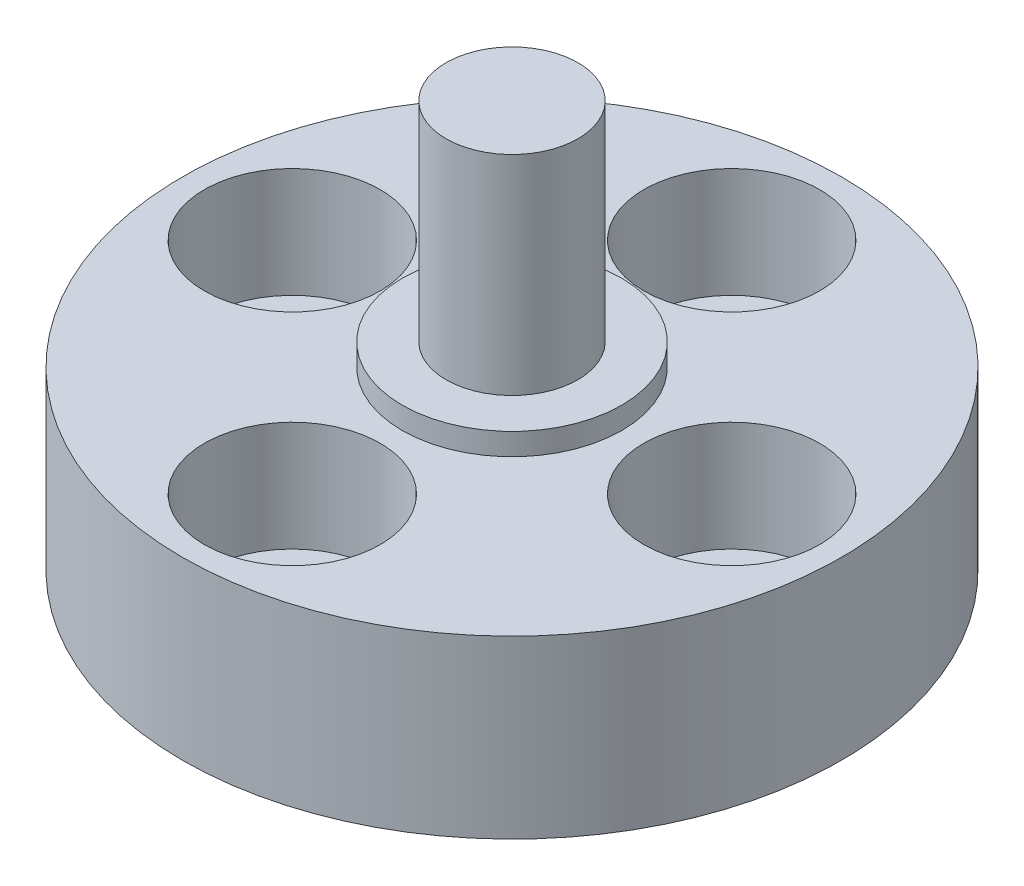
ISO-10303-21;
HEADER;
FILE_DESCRIPTION(('STEP AP214'),'2;1');
FILE_NAME('part.step','',(''),(''),'','','');
FILE_SCHEMA(('AUTOMOTIVE_DESIGN { 1 0 10303 214 1 1 1 1 }'));
ENDSEC;
DATA;
#1=APPLICATION_CONTEXT('core data for automotive mechanical design processes');
#2=APPLICATION_PROTOCOL_DEFINITION('international standard','automotive_design',2000,#1);
#3=PRODUCT_CONTEXT('',#1,'mechanical');
#4=PRODUCT('Part','Part','',(#3));
#5=PRODUCT_RELATED_PRODUCT_CATEGORY('part','',(#4));
#6=PRODUCT_DEFINITION_FORMATION('','',#4);
#7=PRODUCT_DEFINITION_CONTEXT('part definition',#1,'design');
#8=PRODUCT_DEFINITION('design','',#6,#7);
#9=PRODUCT_DEFINITION_SHAPE('','',#8);
#10=(LENGTH_UNIT() NAMED_UNIT(*) SI_UNIT(.MILLI.,.METRE.));
#11=(NAMED_UNIT(*) PLANE_ANGLE_UNIT() SI_UNIT($,.RADIAN.));
#12=(NAMED_UNIT(*) SI_UNIT($,.STERADIAN.) SOLID_ANGLE_UNIT());
#13=UNCERTAINTY_MEASURE_WITH_UNIT(LENGTH_MEASURE(1.E-05),#10,'distance_accuracy_value','');
#14=(GEOMETRIC_REPRESENTATION_CONTEXT(3) GLOBAL_UNCERTAINTY_ASSIGNED_CONTEXT((#13)) GLOBAL_UNIT_ASSIGNED_CONTEXT((#10,
#11,#12)) REPRESENTATION_CONTEXT('',''));
#15=CARTESIAN_POINT('',(0.,0.,0.));
#16=DIRECTION('',(0.,0.,1.));
#17=DIRECTION('',(1.,0.,0.));
#18=AXIS2_PLACEMENT_3D('',#15,#16,#17);
#19=CARTESIAN_POINT('',(0.,8.,0.));
#20=DIRECTION('',(0.,-1.,0.));
#21=DIRECTION('',(0.,0.,-1.));
#22=AXIS2_PLACEMENT_3D('',#19,#20,#21);
#23=CYLINDRICAL_SURFACE('',#22,15.);
#24=CARTESIAN_POINT('',(0.,8.,0.));
#25=DIRECTION('',(0.,1.,0.));
#26=DIRECTION('',(0.,0.,1.));
#27=AXIS2_PLACEMENT_3D('',#24,#25,#26);
#28=CIRCLE('',#27,15.);
#29=CARTESIAN_POINT('',(0.,8.,15.));
#30=VERTEX_POINT('',#29);
#31=EDGE_CURVE('E57',#30,#30,#28,.T.);
#32=ORIENTED_EDGE('',*,*,#31,.F.);
#33=EDGE_LOOP('',(#32));
#34=FACE_BOUND('',#33,.T.);
#35=CARTESIAN_POINT('',(0.,0.,0.));
#36=DIRECTION('',(0.,1.,0.));
#37=DIRECTION('',(0.,0.,1.));
#38=AXIS2_PLACEMENT_3D('',#35,#36,#37);
#39=CIRCLE('',#38,15.);
#40=CARTESIAN_POINT('',(0.,0.,15.));
#41=VERTEX_POINT('',#40);
#42=EDGE_CURVE('E46',#41,#41,#39,.T.);
#43=ORIENTED_EDGE('',*,*,#42,.T.);
#44=EDGE_LOOP('',(#43));
#45=FACE_BOUND('',#44,.T.);
#46=ADVANCED_FACE('F43',(#34,#45),#23,.T.);
#47=CARTESIAN_POINT('',(0.,8.,0.));
#48=DIRECTION('',(0.,1.,0.));
#49=DIRECTION('',(0.,0.,1.));
#50=AXIS2_PLACEMENT_3D('',#47,#48,#49);
#51=PLANE('',#50);
#52=CARTESIAN_POINT('',(-10.,8.,0.));
#53=DIRECTION('',(0.,1.,0.));
#54=DIRECTION('',(0.,0.,1.));
#55=AXIS2_PLACEMENT_3D('',#52,#53,#54);
#56=CIRCLE('',#55,4.00000000000001);
#57=CARTESIAN_POINT('',(-10.,8.,4.00000000000001));
#58=VERTEX_POINT('',#57);
#59=EDGE_CURVE('E269',#58,#58,#56,.T.);
#60=ORIENTED_EDGE('',*,*,#59,.F.);
#61=EDGE_LOOP('',(#60));
#62=FACE_BOUND('',#61,.T.);
#63=CARTESIAN_POINT('',(0.,8.,-10.));
#64=DIRECTION('',(0.,1.,0.));
#65=DIRECTION('',(0.,0.,1.));
#66=AXIS2_PLACEMENT_3D('',#63,#64,#65);
#67=CIRCLE('',#66,4.00000000000001);
#68=CARTESIAN_POINT('',(0.,8.,-5.99999999999999));
#69=VERTEX_POINT('',#68);
#70=EDGE_CURVE('E282',#69,#69,#67,.T.);
#71=ORIENTED_EDGE('',*,*,#70,.F.);
#72=EDGE_LOOP('',(#71));
#73=FACE_BOUND('',#72,.T.);
#74=CARTESIAN_POINT('',(10.,8.,0.));
#75=DIRECTION('',(0.,1.,0.));
#76=DIRECTION('',(0.,0.,1.));
#77=AXIS2_PLACEMENT_3D('',#74,#75,#76);
#78=CIRCLE('',#77,4.00000000000001);
#79=CARTESIAN_POINT('',(10.,8.,4.00000000000001));
#80=VERTEX_POINT('',#79);
#81=EDGE_CURVE('E298',#80,#80,#78,.T.);
#82=ORIENTED_EDGE('',*,*,#81,.F.);
#83=EDGE_LOOP('',(#82));
#84=FACE_BOUND('',#83,.T.);
#85=CARTESIAN_POINT('',(0.,8.,10.));
#86=DIRECTION('',(0.,1.,0.));
#87=DIRECTION('',(0.,0.,1.));
#88=AXIS2_PLACEMENT_3D('',#85,#86,#87);
#89=CIRCLE('',#88,4.00000000000001);
#90=CARTESIAN_POINT('',(0.,8.,14.));
#91=VERTEX_POINT('',#90);
#92=EDGE_CURVE('E314',#91,#91,#89,.T.);
#93=ORIENTED_EDGE('',*,*,#92,.F.);
#94=EDGE_LOOP('',(#93));
#95=FACE_BOUND('',#94,.T.);
#96=CARTESIAN_POINT('',(0.,8.,0.));
#97=DIRECTION('',(0.,1.,0.));
#98=DIRECTION('',(0.,0.,1.));
#99=AXIS2_PLACEMENT_3D('',#96,#97,#98);
#100=CIRCLE('',#99,5.);
#101=CARTESIAN_POINT('',(0.,8.,5.));
#102=VERTEX_POINT('',#101);
#103=EDGE_CURVE('E51',#102,#102,#100,.T.);
#104=ORIENTED_EDGE('',*,*,#103,.F.);
#105=EDGE_LOOP('',(#104));
#106=FACE_BOUND('',#105,.T.);
#107=ORIENTED_EDGE('',*,*,#31,.T.);
#108=EDGE_LOOP('',(#107));
#109=FACE_BOUND('',#108,.T.);
#110=ADVANCED_FACE('F78',(#62,#73,#84,#95,#106,#109),#51,.T.);
#111=CARTESIAN_POINT('',(0.,0.,0.));
#112=DIRECTION('',(0.,1.,0.));
#113=DIRECTION('',(0.,0.,1.));
#114=AXIS2_PLACEMENT_3D('',#111,#112,#113);
#115=PLANE('',#114);
#116=CARTESIAN_POINT('',(-10.,0.,0.));
#117=DIRECTION('',(0.,1.,0.));
#118=DIRECTION('',(0.,0.,1.));
#119=AXIS2_PLACEMENT_3D('',#116,#117,#118);
#120=CIRCLE('',#119,2.00000000000001);
#121=CARTESIAN_POINT('',(-10.,0.,2.00000000000001));
#122=VERTEX_POINT('',#121);
#123=EDGE_CURVE('E279',#122,#122,#120,.T.);
#124=ORIENTED_EDGE('',*,*,#123,.T.);
#125=EDGE_LOOP('',(#124));
#126=FACE_BOUND('',#125,.T.);
#127=CARTESIAN_POINT('',(0.,0.,-10.));
#128=DIRECTION('',(0.,1.,0.));
#129=DIRECTION('',(0.,0.,1.));
#130=AXIS2_PLACEMENT_3D('',#127,#128,#129);
#131=CIRCLE('',#130,2.00000000000001);
#132=CARTESIAN_POINT('',(0.,0.,-7.99999999999999));
#133=VERTEX_POINT('',#132);
#134=EDGE_CURVE('E294',#133,#133,#131,.T.);
#135=ORIENTED_EDGE('',*,*,#134,.T.);
#136=EDGE_LOOP('',(#135));
#137=FACE_BOUND('',#136,.T.);
#138=CARTESIAN_POINT('',(10.,0.,0.));
#139=DIRECTION('',(0.,1.,0.));
#140=DIRECTION('',(0.,0.,1.));
#141=AXIS2_PLACEMENT_3D('',#138,#139,#140);
#142=CIRCLE('',#141,2.00000000000001);
#143=CARTESIAN_POINT('',(10.,0.,2.00000000000001));
#144=VERTEX_POINT('',#143);
#145=EDGE_CURVE('E310',#144,#144,#142,.T.);
#146=ORIENTED_EDGE('',*,*,#145,.T.);
#147=EDGE_LOOP('',(#146));
#148=FACE_BOUND('',#147,.T.);
#149=CARTESIAN_POINT('',(0.,0.,10.));
#150=DIRECTION('',(0.,1.,0.));
#151=DIRECTION('',(0.,0.,1.));
#152=AXIS2_PLACEMENT_3D('',#149,#150,#151);
#153=CIRCLE('',#152,2.00000000000001);
#154=CARTESIAN_POINT('',(0.,0.,12.));
#155=VERTEX_POINT('',#154);
#156=EDGE_CURVE('E325',#155,#155,#153,.T.);
#157=ORIENTED_EDGE('',*,*,#156,.T.);
#158=EDGE_LOOP('',(#157));
#159=FACE_BOUND('',#158,.T.);
#160=ORIENTED_EDGE('',*,*,#42,.F.);
#161=EDGE_LOOP('',(#160));
#162=FACE_BOUND('',#161,.T.);
#163=ADVANCED_FACE('F75',(#126,#137,#148,#159,#162),#115,.F.);
#164=CARTESIAN_POINT('',(0.,9.,0.));
#165=DIRECTION('',(0.,-1.,0.));
#166=DIRECTION('',(0.,0.,-1.));
#167=AXIS2_PLACEMENT_3D('',#164,#165,#166);
#168=CYLINDRICAL_SURFACE('',#167,5.);
#169=CARTESIAN_POINT('',(0.,9.,0.));
#170=DIRECTION('',(0.,1.,0.));
#171=DIRECTION('',(0.,0.,1.));
#172=AXIS2_PLACEMENT_3D('',#169,#170,#171);
#173=CIRCLE('',#172,5.);
#174=CARTESIAN_POINT('',(0.,9.,5.));
#175=VERTEX_POINT('',#174);
#176=EDGE_CURVE('E63',#175,#175,#173,.T.);
#177=ORIENTED_EDGE('',*,*,#176,.F.);
#178=EDGE_LOOP('',(#177));
#179=FACE_BOUND('',#178,.T.);
#180=ORIENTED_EDGE('',*,*,#103,.T.);
#181=EDGE_LOOP('',(#180));
#182=FACE_BOUND('',#181,.T.);
#183=ADVANCED_FACE('F77',(#179,#182),#168,.T.);
#184=CARTESIAN_POINT('',(0.,9.,0.));
#185=DIRECTION('',(0.,1.,0.));
#186=DIRECTION('',(0.,0.,1.));
#187=AXIS2_PLACEMENT_3D('',#184,#185,#186);
#188=PLANE('',#187);
#189=CARTESIAN_POINT('',(0.,9.,0.));
#190=DIRECTION('',(0.,1.,0.));
#191=DIRECTION('',(0.,0.,1.));
#192=AXIS2_PLACEMENT_3D('',#189,#190,#191);
#193=CIRCLE('',#192,3.);
#194=CARTESIAN_POINT('',(0.,9.,3.));
#195=VERTEX_POINT('',#194);
#196=EDGE_CURVE('E10',#195,#195,#193,.T.);
#197=ORIENTED_EDGE('',*,*,#196,.F.);
#198=EDGE_LOOP('',(#197));
#199=FACE_BOUND('',#198,.T.);
#200=ORIENTED_EDGE('',*,*,#176,.T.);
#201=EDGE_LOOP('',(#200));
#202=FACE_BOUND('',#201,.T.);
#203=ADVANCED_FACE('F85',(#199,#202),#188,.T.);
#204=CARTESIAN_POINT('',(0.,18.5,0.));
#205=DIRECTION('',(0.,-1.,0.));
#206=DIRECTION('',(0.,0.,-1.));
#207=AXIS2_PLACEMENT_3D('',#204,#205,#206);
#208=CYLINDRICAL_SURFACE('',#207,3.);
#209=CARTESIAN_POINT('',(0.,18.5,0.));
#210=DIRECTION('',(0.,1.,0.));
#211=DIRECTION('',(0.,0.,1.));
#212=AXIS2_PLACEMENT_3D('',#209,#210,#211);
#213=CIRCLE('',#212,3.);
#214=CARTESIAN_POINT('',(0.,18.5,3.));
#215=VERTEX_POINT('',#214);
#216=EDGE_CURVE('E61',#215,#215,#213,.T.);
#217=ORIENTED_EDGE('',*,*,#216,.F.);
#218=EDGE_LOOP('',(#217));
#219=FACE_BOUND('',#218,.T.);
#220=ORIENTED_EDGE('',*,*,#196,.T.);
#221=EDGE_LOOP('',(#220));
#222=FACE_BOUND('',#221,.T.);
#223=ADVANCED_FACE('F109',(#219,#222),#208,.T.);
#224=CARTESIAN_POINT('',(0.,18.5,0.));
#225=DIRECTION('',(0.,1.,0.));
#226=DIRECTION('',(0.,0.,1.));
#227=AXIS2_PLACEMENT_3D('',#224,#225,#226);
#228=PLANE('',#227);
#229=ORIENTED_EDGE('',*,*,#216,.T.);
#230=EDGE_LOOP('',(#229));
#231=FACE_BOUND('',#230,.T.);
#232=ADVANCED_FACE('F118',(#231),#228,.T.);
#233=CARTESIAN_POINT('',(0.,8.,10.));
#234=DIRECTION('',(0.,1.,0.));
#235=DIRECTION('',(0.,0.,1.));
#236=AXIS2_PLACEMENT_3D('',#233,#234,#235);
#237=CYLINDRICAL_SURFACE('',#236,2.00000000000001);
#238=ORIENTED_EDGE('',*,*,#156,.F.);
#239=EDGE_LOOP('',(#238));
#240=FACE_BOUND('',#239,.T.);
#241=CARTESIAN_POINT('',(0.,3.,10.));
#242=DIRECTION('',(0.,1.,0.));
#243=DIRECTION('',(0.,0.,1.));
#244=AXIS2_PLACEMENT_3D('',#241,#242,#243);
#245=CIRCLE('',#244,2.00000000000001);
#246=CARTESIAN_POINT('',(0.,3.,12.));
#247=VERTEX_POINT('',#246);
#248=EDGE_CURVE('E322',#247,#247,#245,.T.);
#249=ORIENTED_EDGE('',*,*,#248,.T.);
#250=EDGE_LOOP('',(#249));
#251=FACE_BOUND('',#250,.T.);
#252=ADVANCED_FACE('F126',(#240,#251),#237,.F.);
#253=CARTESIAN_POINT('',(2.00000000000001,3.,10.));
#254=DIRECTION('',(0.,-1.,0.));
#255=DIRECTION('',(0.,0.,-1.));
#256=AXIS2_PLACEMENT_3D('',#253,#254,#255);
#257=PLANE('',#256);
#258=ORIENTED_EDGE('',*,*,#248,.F.);
#259=EDGE_LOOP('',(#258));
#260=FACE_BOUND('',#259,.T.);
#261=CARTESIAN_POINT('',(0.,3.,10.));
#262=DIRECTION('',(0.,1.,0.));
#263=DIRECTION('',(0.,0.,1.));
#264=AXIS2_PLACEMENT_3D('',#261,#262,#263);
#265=CIRCLE('',#264,4.00000000000001);
#266=CARTESIAN_POINT('',(0.,3.,14.));
#267=VERTEX_POINT('',#266);
#268=EDGE_CURVE('E318',#267,#267,#265,.T.);
#269=ORIENTED_EDGE('',*,*,#268,.T.);
#270=EDGE_LOOP('',(#269));
#271=FACE_BOUND('',#270,.T.);
#272=ADVANCED_FACE('F149',(#260,#271),#257,.F.);
#273=CARTESIAN_POINT('',(0.,8.,10.));
#274=DIRECTION('',(0.,1.,0.));
#275=DIRECTION('',(0.,0.,1.));
#276=AXIS2_PLACEMENT_3D('',#273,#274,#275);
#277=CYLINDRICAL_SURFACE('',#276,4.00000000000001);
#278=ORIENTED_EDGE('',*,*,#268,.F.);
#279=EDGE_LOOP('',(#278));
#280=FACE_BOUND('',#279,.T.);
#281=ORIENTED_EDGE('',*,*,#92,.T.);
#282=EDGE_LOOP('',(#281));
#283=FACE_BOUND('',#282,.T.);
#284=ADVANCED_FACE('F158',(#280,#283),#277,.F.);
#285=CARTESIAN_POINT('',(10.,8.,0.));
#286=DIRECTION('',(0.,1.,0.));
#287=DIRECTION('',(0.,0.,1.));
#288=AXIS2_PLACEMENT_3D('',#285,#286,#287);
#289=CYLINDRICAL_SURFACE('',#288,2.00000000000001);
#290=ORIENTED_EDGE('',*,*,#145,.F.);
#291=EDGE_LOOP('',(#290));
#292=FACE_BOUND('',#291,.T.);
#293=CARTESIAN_POINT('',(10.,3.,0.));
#294=DIRECTION('',(0.,1.,0.));
#295=DIRECTION('',(0.,0.,1.));
#296=AXIS2_PLACEMENT_3D('',#293,#294,#295);
#297=CIRCLE('',#296,2.00000000000001);
#298=CARTESIAN_POINT('',(10.,3.,2.00000000000001));
#299=VERTEX_POINT('',#298);
#300=EDGE_CURVE('E306',#299,#299,#297,.T.);
#301=ORIENTED_EDGE('',*,*,#300,.T.);
#302=EDGE_LOOP('',(#301));
#303=FACE_BOUND('',#302,.T.);
#304=ADVANCED_FACE('F167',(#292,#303),#289,.F.);
#305=CARTESIAN_POINT('',(12.,3.,0.));
#306=DIRECTION('',(0.,-1.,0.));
#307=DIRECTION('',(0.,0.,-1.));
#308=AXIS2_PLACEMENT_3D('',#305,#306,#307);
#309=PLANE('',#308);
#310=ORIENTED_EDGE('',*,*,#300,.F.);
#311=EDGE_LOOP('',(#310));
#312=FACE_BOUND('',#311,.T.);
#313=CARTESIAN_POINT('',(10.,3.,0.));
#314=DIRECTION('',(0.,1.,0.));
#315=DIRECTION('',(0.,0.,1.));
#316=AXIS2_PLACEMENT_3D('',#313,#314,#315);
#317=CIRCLE('',#316,4.00000000000001);
#318=CARTESIAN_POINT('',(10.,3.,4.00000000000001));
#319=VERTEX_POINT('',#318);
#320=EDGE_CURVE('E302',#319,#319,#317,.T.);
#321=ORIENTED_EDGE('',*,*,#320,.T.);
#322=EDGE_LOOP('',(#321));
#323=FACE_BOUND('',#322,.T.);
#324=ADVANCED_FACE('F176',(#312,#323),#309,.F.);
#325=CARTESIAN_POINT('',(10.,8.,0.));
#326=DIRECTION('',(0.,1.,0.));
#327=DIRECTION('',(0.,0.,1.));
#328=AXIS2_PLACEMENT_3D('',#325,#326,#327);
#329=CYLINDRICAL_SURFACE('',#328,4.00000000000001);
#330=ORIENTED_EDGE('',*,*,#320,.F.);
#331=EDGE_LOOP('',(#330));
#332=FACE_BOUND('',#331,.T.);
#333=ORIENTED_EDGE('',*,*,#81,.T.);
#334=EDGE_LOOP('',(#333));
#335=FACE_BOUND('',#334,.T.);
#336=ADVANCED_FACE('F185',(#332,#335),#329,.F.);
#337=CARTESIAN_POINT('',(0.,8.,-10.));
#338=DIRECTION('',(0.,1.,0.));
#339=DIRECTION('',(0.,0.,1.));
#340=AXIS2_PLACEMENT_3D('',#337,#338,#339);
#341=CYLINDRICAL_SURFACE('',#340,2.00000000000001);
#342=ORIENTED_EDGE('',*,*,#134,.F.);
#343=EDGE_LOOP('',(#342));
#344=FACE_BOUND('',#343,.T.);
#345=CARTESIAN_POINT('',(0.,3.,-10.));
#346=DIRECTION('',(0.,1.,0.));
#347=DIRECTION('',(0.,0.,1.));
#348=AXIS2_PLACEMENT_3D('',#345,#346,#347);
#349=CIRCLE('',#348,2.00000000000001);
#350=CARTESIAN_POINT('',(0.,3.,-7.99999999999999));
#351=VERTEX_POINT('',#350);
#352=EDGE_CURVE('E290',#351,#351,#349,.T.);
#353=ORIENTED_EDGE('',*,*,#352,.T.);
#354=EDGE_LOOP('',(#353));
#355=FACE_BOUND('',#354,.T.);
#356=ADVANCED_FACE('F194',(#344,#355),#341,.F.);
#357=CARTESIAN_POINT('',(2.00000000000001,3.,-10.));
#358=DIRECTION('',(0.,-1.,0.));
#359=DIRECTION('',(0.,0.,-1.));
#360=AXIS2_PLACEMENT_3D('',#357,#358,#359);
#361=PLANE('',#360);
#362=ORIENTED_EDGE('',*,*,#352,.F.);
#363=EDGE_LOOP('',(#362));
#364=FACE_BOUND('',#363,.T.);
#365=CARTESIAN_POINT('',(0.,3.,-10.));
#366=DIRECTION('',(0.,1.,0.));
#367=DIRECTION('',(0.,0.,1.));
#368=AXIS2_PLACEMENT_3D('',#365,#366,#367);
#369=CIRCLE('',#368,4.00000000000001);
#370=CARTESIAN_POINT('',(0.,3.,-5.99999999999999));
#371=VERTEX_POINT('',#370);
#372=EDGE_CURVE('E286',#371,#371,#369,.T.);
#373=ORIENTED_EDGE('',*,*,#372,.T.);
#374=EDGE_LOOP('',(#373));
#375=FACE_BOUND('',#374,.T.);
#376=ADVANCED_FACE('F203',(#364,#375),#361,.F.);
#377=CARTESIAN_POINT('',(0.,8.,-10.));
#378=DIRECTION('',(0.,1.,0.));
#379=DIRECTION('',(0.,0.,1.));
#380=AXIS2_PLACEMENT_3D('',#377,#378,#379);
#381=CYLINDRICAL_SURFACE('',#380,4.00000000000001);
#382=ORIENTED_EDGE('',*,*,#372,.F.);
#383=EDGE_LOOP('',(#382));
#384=FACE_BOUND('',#383,.T.);
#385=ORIENTED_EDGE('',*,*,#70,.T.);
#386=EDGE_LOOP('',(#385));
#387=FACE_BOUND('',#386,.T.);
#388=ADVANCED_FACE('F212',(#384,#387),#381,.F.);
#389=CARTESIAN_POINT('',(-10.,8.,0.));
#390=DIRECTION('',(0.,1.,0.));
#391=DIRECTION('',(0.,0.,1.));
#392=AXIS2_PLACEMENT_3D('',#389,#390,#391);
#393=CYLINDRICAL_SURFACE('',#392,2.00000000000001);
#394=ORIENTED_EDGE('',*,*,#123,.F.);
#395=EDGE_LOOP('',(#394));
#396=FACE_BOUND('',#395,.T.);
#397=CARTESIAN_POINT('',(-10.,3.,0.));
#398=DIRECTION('',(0.,1.,0.));
#399=DIRECTION('',(0.,0.,1.));
#400=AXIS2_PLACEMENT_3D('',#397,#398,#399);
#401=CIRCLE('',#400,2.00000000000001);
#402=CARTESIAN_POINT('',(-10.,3.,2.00000000000001));
#403=VERTEX_POINT('',#402);
#404=EDGE_CURVE('E273',#403,#403,#401,.T.);
#405=ORIENTED_EDGE('',*,*,#404,.T.);
#406=EDGE_LOOP('',(#405));
#407=FACE_BOUND('',#406,.T.);
#408=ADVANCED_FACE('F221',(#396,#407),#393,.F.);
#409=CARTESIAN_POINT('',(-7.99999999999999,3.,0.));
#410=DIRECTION('',(0.,-1.,0.));
#411=DIRECTION('',(0.,0.,-1.));
#412=AXIS2_PLACEMENT_3D('',#409,#410,#411);
#413=PLANE('',#412);
#414=ORIENTED_EDGE('',*,*,#404,.F.);
#415=EDGE_LOOP('',(#414));
#416=FACE_BOUND('',#415,.T.);
#417=CARTESIAN_POINT('',(-10.,3.,0.));
#418=DIRECTION('',(0.,1.,0.));
#419=DIRECTION('',(0.,0.,1.));
#420=AXIS2_PLACEMENT_3D('',#417,#418,#419);
#421=CIRCLE('',#420,4.00000000000001);
#422=CARTESIAN_POINT('',(-10.,3.,4.00000000000001));
#423=VERTEX_POINT('',#422);
#424=EDGE_CURVE('E266',#423,#423,#421,.T.);
#425=ORIENTED_EDGE('',*,*,#424,.T.);
#426=EDGE_LOOP('',(#425));
#427=FACE_BOUND('',#426,.T.);
#428=ADVANCED_FACE('F230',(#416,#427),#413,.F.);
#429=CARTESIAN_POINT('',(-10.,8.,0.));
#430=DIRECTION('',(0.,1.,0.));
#431=DIRECTION('',(0.,0.,1.));
#432=AXIS2_PLACEMENT_3D('',#429,#430,#431);
#433=CYLINDRICAL_SURFACE('',#432,4.00000000000001);
#434=ORIENTED_EDGE('',*,*,#424,.F.);
#435=EDGE_LOOP('',(#434));
#436=FACE_BOUND('',#435,.T.);
#437=ORIENTED_EDGE('',*,*,#59,.T.);
#438=EDGE_LOOP('',(#437));
#439=FACE_BOUND('',#438,.T.);
#440=ADVANCED_FACE('F239',(#436,#439),#433,.F.);
#441=CLOSED_SHELL('',(#46,#110,#163,#183,#203,#223,#232,#252,#272,#284,#304,#324,#336,#356,#376,
#388,#408,#428,#440));
#442=MANIFOLD_SOLID_BREP('B2',#441);
#443=ADVANCED_BREP_SHAPE_REPRESENTATION('',(#18,#442),#14);
#444=SHAPE_DEFINITION_REPRESENTATION(#9,#443);
ENDSEC;
END-ISO-10303-21;
